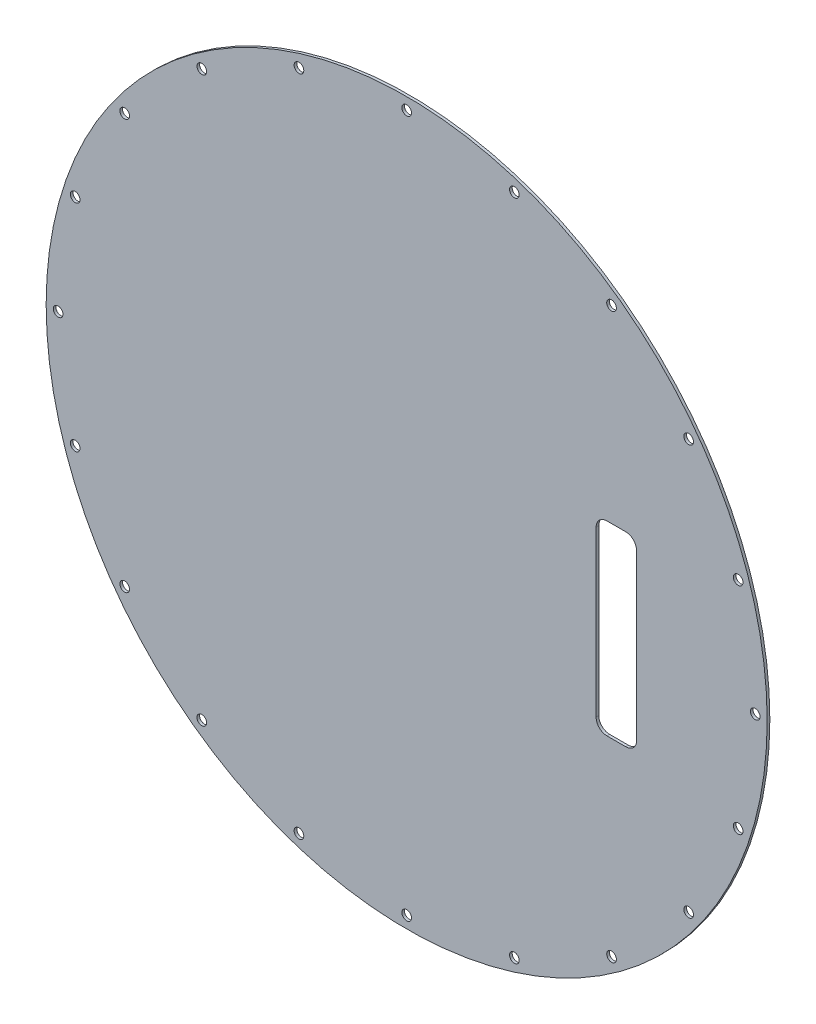
ISO-10303-21;
HEADER;
FILE_DESCRIPTION(('STEP AP214'),'2;1');
FILE_NAME('part.step','',(''),(''),'','','');
FILE_SCHEMA(('AUTOMOTIVE_DESIGN { 1 0 10303 214 1 1 1 1 }'));
ENDSEC;
DATA;
#1=APPLICATION_CONTEXT('core data for automotive mechanical design processes');
#2=APPLICATION_PROTOCOL_DEFINITION('international standard','automotive_design',2000,#1);
#3=PRODUCT_CONTEXT('',#1,'mechanical');
#4=PRODUCT('Part','Part','',(#3));
#5=PRODUCT_RELATED_PRODUCT_CATEGORY('part','',(#4));
#6=PRODUCT_DEFINITION_FORMATION('','',#4);
#7=PRODUCT_DEFINITION_CONTEXT('part definition',#1,'design');
#8=PRODUCT_DEFINITION('design','',#6,#7);
#9=PRODUCT_DEFINITION_SHAPE('','',#8);
#10=(LENGTH_UNIT() NAMED_UNIT(*) SI_UNIT(.MILLI.,.METRE.));
#11=(NAMED_UNIT(*) PLANE_ANGLE_UNIT() SI_UNIT($,.RADIAN.));
#12=(NAMED_UNIT(*) SI_UNIT($,.STERADIAN.) SOLID_ANGLE_UNIT());
#13=UNCERTAINTY_MEASURE_WITH_UNIT(LENGTH_MEASURE(1.E-05),#10,'distance_accuracy_value','');
#14=(GEOMETRIC_REPRESENTATION_CONTEXT(3) GLOBAL_UNCERTAINTY_ASSIGNED_CONTEXT((#13)) GLOBAL_UNIT_ASSIGNED_CONTEXT((#10,
#11,#12)) REPRESENTATION_CONTEXT('',''));
#15=CARTESIAN_POINT('',(0.,0.,0.));
#16=DIRECTION('',(0.,0.,1.));
#17=DIRECTION('',(1.,0.,0.));
#18=AXIS2_PLACEMENT_3D('',#15,#16,#17);
#19=CARTESIAN_POINT('',(-3.7031892570142E-13,0.,230.98252));
#20=DIRECTION('',(0.,0.,1.));
#21=DIRECTION('',(1.,0.,0.));
#22=AXIS2_PLACEMENT_3D('',#19,#20,#21);
#23=PLANE('',#22);
#24=CARTESIAN_POINT('',(86.0490700642058,62.518308896957,230.98252));
#25=DIRECTION('',(0.,0.,-1.));
#26=DIRECTION('',(-1.,0.,0.));
#27=AXIS2_PLACEMENT_3D('',#24,#25,#26);
#28=CIRCLE('',#27,1.47319999999999);
#29=CARTESIAN_POINT('',(84.5758700642058,62.518308896957,230.98252));
#30=VERTEX_POINT('',#29);
#31=EDGE_CURVE('E263',#30,#30,#28,.F.);
#32=ORIENTED_EDGE('',*,*,#31,.T.);
#33=EDGE_LOOP('',(#32));
#34=FACE_BOUND('',#33,.T.);
#35=CARTESIAN_POINT('',(-32.8678200642047,101.156748714444,230.98252));
#36=DIRECTION('',(0.,0.,-1.));
#37=DIRECTION('',(-1.,0.,0.));
#38=AXIS2_PLACEMENT_3D('',#35,#36,#37);
#39=CIRCLE('',#38,1.4732);
#40=CARTESIAN_POINT('',(-34.3410200642047,101.156748714444,230.98252));
#41=VERTEX_POINT('',#40);
#42=EDGE_CURVE('E257',#41,#41,#39,.F.);
#43=ORIENTED_EDGE('',*,*,#42,.T.);
#44=EDGE_LOOP('',(#43));
#45=FACE_BOUND('',#44,.T.);
#46=CARTESIAN_POINT('',(-62.5183088969577,86.0490700642059,230.98252));
#47=DIRECTION('',(0.,0.,-1.));
#48=DIRECTION('',(-1.,0.,0.));
#49=AXIS2_PLACEMENT_3D('',#46,#47,#48);
#50=CIRCLE('',#49,1.47320000000001);
#51=CARTESIAN_POINT('',(-63.9915088969577,86.0490700642059,230.98252));
#52=VERTEX_POINT('',#51);
#53=EDGE_CURVE('E212',#52,#52,#50,.F.);
#54=ORIENTED_EDGE('',*,*,#53,.T.);
#55=EDGE_LOOP('',(#54));
#56=FACE_BOUND('',#55,.T.);
#57=CARTESIAN_POINT('',(-86.0490700642052,62.5183088969589,230.98252));
#58=DIRECTION('',(0.,0.,-1.));
#59=DIRECTION('',(-1.,0.,0.));
#60=AXIS2_PLACEMENT_3D('',#57,#58,#59);
#61=CIRCLE('',#60,1.47319999999999);
#62=CARTESIAN_POINT('',(-87.5222700642052,62.5183088969589,230.98252));
#63=VERTEX_POINT('',#62);
#64=EDGE_CURVE('E215',#63,#63,#61,.F.);
#65=ORIENTED_EDGE('',*,*,#64,.T.);
#66=EDGE_LOOP('',(#65));
#67=FACE_BOUND('',#66,.T.);
#68=CARTESIAN_POINT('',(-106.3625,0.,230.98252));
#69=DIRECTION('',(0.,0.,-1.));
#70=DIRECTION('',(-1.,0.,0.));
#71=AXIS2_PLACEMENT_3D('',#68,#69,#70);
#72=CIRCLE('',#71,1.47319999999999);
#73=CARTESIAN_POINT('',(-107.8357,0.,230.98252));
#74=VERTEX_POINT('',#73);
#75=EDGE_CURVE('E251',#74,#74,#72,.F.);
#76=ORIENTED_EDGE('',*,*,#75,.T.);
#77=EDGE_LOOP('',(#76));
#78=FACE_BOUND('',#77,.T.);
#79=CARTESIAN_POINT('',(-101.156748714444,-32.8678200642047,230.98252));
#80=DIRECTION('',(0.,0.,-1.));
#81=DIRECTION('',(-1.,0.,0.));
#82=AXIS2_PLACEMENT_3D('',#79,#80,#81);
#83=CIRCLE('',#82,1.47319999999999);
#84=CARTESIAN_POINT('',(-102.629948714444,-32.8678200642047,230.98252));
#85=VERTEX_POINT('',#84);
#86=EDGE_CURVE('E218',#85,#85,#83,.F.);
#87=ORIENTED_EDGE('',*,*,#86,.T.);
#88=EDGE_LOOP('',(#87));
#89=FACE_BOUND('',#88,.T.);
#90=CARTESIAN_POINT('',(-86.0490700642061,-62.5183088969577,230.98252));
#91=DIRECTION('',(0.,0.,-1.));
#92=DIRECTION('',(-1.,0.,0.));
#93=AXIS2_PLACEMENT_3D('',#90,#91,#92);
#94=CIRCLE('',#93,1.47319999999999);
#95=CARTESIAN_POINT('',(-87.5222700642061,-62.5183088969577,230.98252));
#96=VERTEX_POINT('',#95);
#97=EDGE_CURVE('E221',#96,#96,#94,.F.);
#98=ORIENTED_EDGE('',*,*,#97,.T.);
#99=EDGE_LOOP('',(#98));
#100=FACE_BOUND('',#99,.T.);
#101=CARTESIAN_POINT('',(-62.518308896959,-86.049070064205,230.98252));
#102=DIRECTION('',(0.,0.,-1.));
#103=DIRECTION('',(-1.,0.,0.));
#104=AXIS2_PLACEMENT_3D('',#101,#102,#103);
#105=CIRCLE('',#104,1.47319999999999);
#106=CARTESIAN_POINT('',(-63.991508896959,-86.049070064205,230.98252));
#107=VERTEX_POINT('',#106);
#108=EDGE_CURVE('E224',#107,#107,#105,.F.);
#109=ORIENTED_EDGE('',*,*,#108,.T.);
#110=EDGE_LOOP('',(#109));
#111=FACE_BOUND('',#110,.T.);
#112=CARTESIAN_POINT('',(-3.7031892570142E-13,0.,230.98252));
#113=DIRECTION('',(0.,0.,-1.));
#114=DIRECTION('',(-1.,0.,0.));
#115=AXIS2_PLACEMENT_3D('',#112,#113,#114);
#116=CIRCLE('',#115,110.01375);
#117=CARTESIAN_POINT('',(-110.01375,0.,230.98252));
#118=VERTEX_POINT('',#117);
#119=EDGE_CURVE('E248',#118,#118,#116,.F.);
#120=ORIENTED_EDGE('',*,*,#119,.F.);
#121=EDGE_LOOP('',(#120));
#122=FACE_BOUND('',#121,.T.);
#123=CARTESIAN_POINT('',(106.3625,0.,230.98252));
#124=DIRECTION('',(0.,0.,-1.));
#125=DIRECTION('',(-1.,0.,0.));
#126=AXIS2_PLACEMENT_3D('',#123,#124,#125);
#127=CIRCLE('',#126,1.47319999999999);
#128=CARTESIAN_POINT('',(104.8893,0.,230.98252));
#129=VERTEX_POINT('',#128);
#130=EDGE_CURVE('E245',#129,#129,#127,.F.);
#131=ORIENTED_EDGE('',*,*,#130,.T.);
#132=EDGE_LOOP('',(#131));
#133=FACE_BOUND('',#132,.T.);
#134=CARTESIAN_POINT('',(101.156748714443,-32.8678200642054,230.98252));
#135=DIRECTION('',(0.,0.,-1.));
#136=DIRECTION('',(-1.,0.,0.));
#137=AXIS2_PLACEMENT_3D('',#134,#135,#136);
#138=CIRCLE('',#137,1.47319999999999);
#139=CARTESIAN_POINT('',(99.6835487144429,-32.8678200642054,230.98252));
#140=VERTEX_POINT('',#139);
#141=EDGE_CURVE('E242',#140,#140,#138,.F.);
#142=ORIENTED_EDGE('',*,*,#141,.T.);
#143=EDGE_LOOP('',(#142));
#144=FACE_BOUND('',#143,.T.);
#145=CARTESIAN_POINT('',(86.0490700642049,-62.5183088969583,230.98252));
#146=DIRECTION('',(0.,0.,-1.));
#147=DIRECTION('',(-1.,0.,0.));
#148=AXIS2_PLACEMENT_3D('',#145,#146,#147);
#149=CIRCLE('',#148,1.47319999999999);
#150=CARTESIAN_POINT('',(84.5758700642049,-62.5183088969583,230.98252));
#151=VERTEX_POINT('',#150);
#152=EDGE_CURVE('E239',#151,#151,#149,.F.);
#153=ORIENTED_EDGE('',*,*,#152,.T.);
#154=EDGE_LOOP('',(#153));
#155=FACE_BOUND('',#154,.T.);
#156=CARTESIAN_POINT('',(62.5183088969576,-86.0490700642055,230.98252));
#157=DIRECTION('',(0.,0.,-1.));
#158=DIRECTION('',(-1.,0.,0.));
#159=AXIS2_PLACEMENT_3D('',#156,#157,#158);
#160=CIRCLE('',#159,1.47319999999999);
#161=CARTESIAN_POINT('',(61.0451088969576,-86.0490700642055,230.98252));
#162=VERTEX_POINT('',#161);
#163=EDGE_CURVE('E236',#162,#162,#160,.F.);
#164=ORIENTED_EDGE('',*,*,#163,.T.);
#165=EDGE_LOOP('',(#164));
#166=FACE_BOUND('',#165,.T.);
#167=CARTESIAN_POINT('',(32.8678200642047,-101.156748714443,230.98252));
#168=DIRECTION('',(0.,0.,-1.));
#169=DIRECTION('',(-1.,0.,0.));
#170=AXIS2_PLACEMENT_3D('',#167,#168,#169);
#171=CIRCLE('',#170,1.4732);
#172=CARTESIAN_POINT('',(31.3946200642047,-101.156748714443,230.98252));
#173=VERTEX_POINT('',#172);
#174=EDGE_CURVE('E233',#173,#173,#171,.F.);
#175=ORIENTED_EDGE('',*,*,#174,.T.);
#176=EDGE_LOOP('',(#175));
#177=FACE_BOUND('',#176,.T.);
#178=CARTESIAN_POINT('',(-7.41681609604123E-13,-106.3625,230.98252));
#179=DIRECTION('',(0.,0.,-1.));
#180=DIRECTION('',(-1.,0.,0.));
#181=AXIS2_PLACEMENT_3D('',#178,#179,#180);
#182=CIRCLE('',#181,1.4732);
#183=CARTESIAN_POINT('',(-1.47320000000074,-106.3625,230.98252));
#184=VERTEX_POINT('',#183);
#185=EDGE_CURVE('E230',#184,#184,#182,.F.);
#186=ORIENTED_EDGE('',*,*,#185,.T.);
#187=EDGE_LOOP('',(#186));
#188=FACE_BOUND('',#187,.T.);
#189=CARTESIAN_POINT('',(-32.8678200642062,-101.156748714443,230.98252));
#190=DIRECTION('',(0.,0.,-1.));
#191=DIRECTION('',(-1.,0.,0.));
#192=AXIS2_PLACEMENT_3D('',#189,#190,#191);
#193=CIRCLE('',#192,1.4732);
#194=CARTESIAN_POINT('',(-34.3410200642062,-101.156748714443,230.98252));
#195=VERTEX_POINT('',#194);
#196=EDGE_CURVE('E227',#195,#195,#193,.F.);
#197=ORIENTED_EDGE('',*,*,#196,.T.);
#198=EDGE_LOOP('',(#197));
#199=FACE_BOUND('',#198,.T.);
#200=CARTESIAN_POINT('',(-101.156748714443,32.8678200642061,230.98252));
#201=DIRECTION('',(0.,0.,-1.));
#202=DIRECTION('',(-1.,0.,0.));
#203=AXIS2_PLACEMENT_3D('',#200,#201,#202);
#204=CIRCLE('',#203,1.47319999999999);
#205=CARTESIAN_POINT('',(-102.629948714443,32.8678200642061,230.98252));
#206=VERTEX_POINT('',#205);
#207=EDGE_CURVE('E254',#206,#206,#204,.F.);
#208=ORIENTED_EDGE('',*,*,#207,.T.);
#209=EDGE_LOOP('',(#208));
#210=FACE_BOUND('',#209,.T.);
#211=CARTESIAN_POINT('',(7.43769126006688E-13,106.3625,230.98252));
#212=DIRECTION('',(0.,0.,-1.));
#213=DIRECTION('',(-1.,0.,0.));
#214=AXIS2_PLACEMENT_3D('',#211,#212,#213);
#215=CIRCLE('',#214,1.4732);
#216=CARTESIAN_POINT('',(-1.47319999999926,106.3625,230.98252));
#217=VERTEX_POINT('',#216);
#218=EDGE_CURVE('E260',#217,#217,#215,.F.);
#219=ORIENTED_EDGE('',*,*,#218,.T.);
#220=EDGE_LOOP('',(#219));
#221=FACE_BOUND('',#220,.T.);
#222=CARTESIAN_POINT('',(32.8678200642061,101.156748714443,230.98252));
#223=DIRECTION('',(0.,0.,-1.));
#224=DIRECTION('',(-1.,0.,0.));
#225=AXIS2_PLACEMENT_3D('',#222,#223,#224);
#226=CIRCLE('',#225,1.4732);
#227=CARTESIAN_POINT('',(31.3946200642061,101.156748714443,230.98252));
#228=VERTEX_POINT('',#227);
#229=EDGE_CURVE('E209',#228,#228,#226,.F.);
#230=ORIENTED_EDGE('',*,*,#229,.T.);
#231=EDGE_LOOP('',(#230));
#232=FACE_BOUND('',#231,.T.);
#233=CARTESIAN_POINT('',(62.5183088969588,86.0490700642046,230.98252));
#234=DIRECTION('',(0.,0.,-1.));
#235=DIRECTION('',(-1.,0.,0.));
#236=AXIS2_PLACEMENT_3D('',#233,#234,#235);
#237=CIRCLE('',#236,1.47319999999999);
#238=CARTESIAN_POINT('',(61.0451088969589,86.0490700642046,230.98252));
#239=VERTEX_POINT('',#238);
#240=EDGE_CURVE('E206',#239,#239,#237,.F.);
#241=ORIENTED_EDGE('',*,*,#240,.T.);
#242=EDGE_LOOP('',(#241));
#243=FACE_BOUND('',#242,.T.);
#244=CARTESIAN_POINT('',(101.156748714443,32.867820064204,230.98252));
#245=DIRECTION('',(0.,0.,-1.));
#246=DIRECTION('',(-1.,0.,0.));
#247=AXIS2_PLACEMENT_3D('',#244,#245,#246);
#248=CIRCLE('',#247,1.47319999999999);
#249=CARTESIAN_POINT('',(99.6835487144433,32.867820064204,230.98252));
#250=VERTEX_POINT('',#249);
#251=EDGE_CURVE('E203',#250,#250,#248,.F.);
#252=ORIENTED_EDGE('',*,*,#251,.T.);
#253=EDGE_LOOP('',(#252));
#254=FACE_BOUND('',#253,.T.);
#255=DIRECTION('',(1.,0.,0.));
#256=VECTOR('',#255,1.);
#257=CARTESIAN_POINT('',(0.,28.4,230.98252));
#258=LINE('',#257,#256);
#259=CARTESIAN_POINT('',(61.1096,28.4,230.98252));
#260=VERTEX_POINT('',#259);
#261=CARTESIAN_POINT('',(66.8556,28.4,230.98252));
#262=VERTEX_POINT('',#261);
#263=EDGE_CURVE('E134',#260,#262,#258,.T.);
#264=ORIENTED_EDGE('',*,*,#263,.F.);
#265=CARTESIAN_POINT('',(61.1096,25.098,230.98252));
#266=DIRECTION('',(0.,0.,1.));
#267=DIRECTION('',(1.,0.,0.));
#268=AXIS2_PLACEMENT_3D('',#265,#266,#267);
#269=CIRCLE('',#268,3.302);
#270=CARTESIAN_POINT('',(57.8076,25.098,230.98252));
#271=VERTEX_POINT('',#270);
#272=EDGE_CURVE('E11',#260,#271,#269,.T.);
#273=ORIENTED_EDGE('',*,*,#272,.T.);
#274=DIRECTION('',(0.,-1.,0.));
#275=VECTOR('',#274,1.);
#276=CARTESIAN_POINT('',(57.8076,0.,230.98252));
#277=LINE('',#276,#275);
#278=CARTESIAN_POINT('',(57.8076,-25.098,230.98252));
#279=VERTEX_POINT('',#278);
#280=EDGE_CURVE('E293',#271,#279,#277,.T.);
#281=ORIENTED_EDGE('',*,*,#280,.T.);
#282=CARTESIAN_POINT('',(61.1096,-25.098,230.98252));
#283=DIRECTION('',(0.,0.,1.));
#284=DIRECTION('',(1.,0.,0.));
#285=AXIS2_PLACEMENT_3D('',#282,#283,#284);
#286=CIRCLE('',#285,3.302);
#287=CARTESIAN_POINT('',(61.1096,-28.4,230.98252));
#288=VERTEX_POINT('',#287);
#289=EDGE_CURVE('E114',#279,#288,#286,.T.);
#290=ORIENTED_EDGE('',*,*,#289,.T.);
#291=DIRECTION('',(1.,0.,0.));
#292=VECTOR('',#291,1.);
#293=CARTESIAN_POINT('',(0.,-28.4,230.98252));
#294=LINE('',#293,#292);
#295=CARTESIAN_POINT('',(66.8556,-28.4,230.98252));
#296=VERTEX_POINT('',#295);
#297=EDGE_CURVE('E124',#288,#296,#294,.T.);
#298=ORIENTED_EDGE('',*,*,#297,.T.);
#299=CARTESIAN_POINT('',(66.8556,-25.098,230.98252));
#300=DIRECTION('',(0.,0.,1.));
#301=DIRECTION('',(1.,0.,0.));
#302=AXIS2_PLACEMENT_3D('',#299,#300,#301);
#303=CIRCLE('',#302,3.302);
#304=CARTESIAN_POINT('',(70.1576,-25.098,230.98252));
#305=VERTEX_POINT('',#304);
#306=EDGE_CURVE('E281',#296,#305,#303,.T.);
#307=ORIENTED_EDGE('',*,*,#306,.T.);
#308=DIRECTION('',(0.,-1.,0.));
#309=VECTOR('',#308,1.);
#310=CARTESIAN_POINT('',(70.1576,0.,230.98252));
#311=LINE('',#310,#309);
#312=CARTESIAN_POINT('',(70.1576,25.098,230.98252));
#313=VERTEX_POINT('',#312);
#314=EDGE_CURVE('E266',#313,#305,#311,.T.);
#315=ORIENTED_EDGE('',*,*,#314,.F.);
#316=CARTESIAN_POINT('',(66.8556,25.098,230.98252));
#317=DIRECTION('',(0.,0.,1.));
#318=DIRECTION('',(1.,0.,0.));
#319=AXIS2_PLACEMENT_3D('',#316,#317,#318);
#320=CIRCLE('',#319,3.302);
#321=EDGE_CURVE('E53',#313,#262,#320,.T.);
#322=ORIENTED_EDGE('',*,*,#321,.T.);
#323=EDGE_LOOP('',(#264,#273,#281,#290,#298,#307,#315,#322));
#324=FACE_BOUND('',#323,.T.);
#325=ADVANCED_FACE('F38',(#34,#45,#56,#67,#78,#89,#100,#111,#122,#133,#144,#155,#166,#177,#188,
#199,#210,#221,#232,#243,#254,#324),#23,.F.);
#326=CARTESIAN_POINT('',(-3.7031892570142E-13,0.,231.79532));
#327=DIRECTION('',(0.,0.,1.));
#328=DIRECTION('',(1.,0.,0.));
#329=AXIS2_PLACEMENT_3D('',#326,#327,#328);
#330=PLANE('',#329);
#331=CARTESIAN_POINT('',(101.156748714443,32.867820064204,231.79532));
#332=DIRECTION('',(0.,0.,-1.));
#333=DIRECTION('',(-1.,0.,0.));
#334=AXIS2_PLACEMENT_3D('',#331,#332,#333);
#335=CIRCLE('',#334,1.47319999999999);
#336=CARTESIAN_POINT('',(99.6835487144433,32.867820064204,231.79532));
#337=VERTEX_POINT('',#336);
#338=EDGE_CURVE('E140',#337,#337,#335,.T.);
#339=ORIENTED_EDGE('',*,*,#338,.T.);
#340=EDGE_LOOP('',(#339));
#341=FACE_BOUND('',#340,.T.);
#342=CARTESIAN_POINT('',(62.5183088969588,86.0490700642046,231.79532));
#343=DIRECTION('',(0.,0.,-1.));
#344=DIRECTION('',(-1.,0.,0.));
#345=AXIS2_PLACEMENT_3D('',#342,#343,#344);
#346=CIRCLE('',#345,1.47319999999999);
#347=CARTESIAN_POINT('',(61.0451088969589,86.0490700642046,231.79532));
#348=VERTEX_POINT('',#347);
#349=EDGE_CURVE('E143',#348,#348,#346,.T.);
#350=ORIENTED_EDGE('',*,*,#349,.T.);
#351=EDGE_LOOP('',(#350));
#352=FACE_BOUND('',#351,.T.);
#353=CARTESIAN_POINT('',(32.8678200642061,101.156748714443,231.79532));
#354=DIRECTION('',(0.,0.,-1.));
#355=DIRECTION('',(-1.,0.,0.));
#356=AXIS2_PLACEMENT_3D('',#353,#354,#355);
#357=CIRCLE('',#356,1.4732);
#358=CARTESIAN_POINT('',(31.3946200642061,101.156748714443,231.79532));
#359=VERTEX_POINT('',#358);
#360=EDGE_CURVE('E146',#359,#359,#357,.T.);
#361=ORIENTED_EDGE('',*,*,#360,.T.);
#362=EDGE_LOOP('',(#361));
#363=FACE_BOUND('',#362,.T.);
#364=CARTESIAN_POINT('',(-62.5183088969577,86.0490700642059,231.79532));
#365=DIRECTION('',(0.,0.,-1.));
#366=DIRECTION('',(-1.,0.,0.));
#367=AXIS2_PLACEMENT_3D('',#364,#365,#366);
#368=CIRCLE('',#367,1.47320000000001);
#369=CARTESIAN_POINT('',(-63.9915088969577,86.0490700642059,231.79532));
#370=VERTEX_POINT('',#369);
#371=EDGE_CURVE('E149',#370,#370,#368,.T.);
#372=ORIENTED_EDGE('',*,*,#371,.T.);
#373=EDGE_LOOP('',(#372));
#374=FACE_BOUND('',#373,.T.);
#375=CARTESIAN_POINT('',(-86.0490700642052,62.5183088969589,231.79532));
#376=DIRECTION('',(0.,0.,-1.));
#377=DIRECTION('',(-1.,0.,0.));
#378=AXIS2_PLACEMENT_3D('',#375,#376,#377);
#379=CIRCLE('',#378,1.47319999999999);
#380=CARTESIAN_POINT('',(-87.5222700642052,62.5183088969589,231.79532));
#381=VERTEX_POINT('',#380);
#382=EDGE_CURVE('E152',#381,#381,#379,.T.);
#383=ORIENTED_EDGE('',*,*,#382,.T.);
#384=EDGE_LOOP('',(#383));
#385=FACE_BOUND('',#384,.T.);
#386=CARTESIAN_POINT('',(-101.156748714444,-32.8678200642047,231.79532));
#387=DIRECTION('',(0.,0.,-1.));
#388=DIRECTION('',(-1.,0.,0.));
#389=AXIS2_PLACEMENT_3D('',#386,#387,#388);
#390=CIRCLE('',#389,1.47319999999999);
#391=CARTESIAN_POINT('',(-102.629948714444,-32.8678200642047,231.79532));
#392=VERTEX_POINT('',#391);
#393=EDGE_CURVE('E155',#392,#392,#390,.T.);
#394=ORIENTED_EDGE('',*,*,#393,.T.);
#395=EDGE_LOOP('',(#394));
#396=FACE_BOUND('',#395,.T.);
#397=CARTESIAN_POINT('',(-86.0490700642061,-62.5183088969577,231.79532));
#398=DIRECTION('',(0.,0.,-1.));
#399=DIRECTION('',(-1.,0.,0.));
#400=AXIS2_PLACEMENT_3D('',#397,#398,#399);
#401=CIRCLE('',#400,1.47319999999999);
#402=CARTESIAN_POINT('',(-87.5222700642061,-62.5183088969577,231.79532));
#403=VERTEX_POINT('',#402);
#404=EDGE_CURVE('E158',#403,#403,#401,.T.);
#405=ORIENTED_EDGE('',*,*,#404,.T.);
#406=EDGE_LOOP('',(#405));
#407=FACE_BOUND('',#406,.T.);
#408=CARTESIAN_POINT('',(-62.518308896959,-86.049070064205,231.79532));
#409=DIRECTION('',(0.,0.,-1.));
#410=DIRECTION('',(-1.,0.,0.));
#411=AXIS2_PLACEMENT_3D('',#408,#409,#410);
#412=CIRCLE('',#411,1.47319999999999);
#413=CARTESIAN_POINT('',(-63.991508896959,-86.049070064205,231.79532));
#414=VERTEX_POINT('',#413);
#415=EDGE_CURVE('E161',#414,#414,#412,.T.);
#416=ORIENTED_EDGE('',*,*,#415,.T.);
#417=EDGE_LOOP('',(#416));
#418=FACE_BOUND('',#417,.T.);
#419=CARTESIAN_POINT('',(-32.8678200642062,-101.156748714443,231.79532));
#420=DIRECTION('',(0.,0.,-1.));
#421=DIRECTION('',(-1.,0.,0.));
#422=AXIS2_PLACEMENT_3D('',#419,#420,#421);
#423=CIRCLE('',#422,1.4732);
#424=CARTESIAN_POINT('',(-34.3410200642062,-101.156748714443,231.79532));
#425=VERTEX_POINT('',#424);
#426=EDGE_CURVE('E164',#425,#425,#423,.T.);
#427=ORIENTED_EDGE('',*,*,#426,.T.);
#428=EDGE_LOOP('',(#427));
#429=FACE_BOUND('',#428,.T.);
#430=CARTESIAN_POINT('',(-7.41681609604123E-13,-106.3625,231.79532));
#431=DIRECTION('',(0.,0.,-1.));
#432=DIRECTION('',(-1.,0.,0.));
#433=AXIS2_PLACEMENT_3D('',#430,#431,#432);
#434=CIRCLE('',#433,1.4732);
#435=CARTESIAN_POINT('',(-1.47320000000074,-106.3625,231.79532));
#436=VERTEX_POINT('',#435);
#437=EDGE_CURVE('E167',#436,#436,#434,.T.);
#438=ORIENTED_EDGE('',*,*,#437,.T.);
#439=EDGE_LOOP('',(#438));
#440=FACE_BOUND('',#439,.T.);
#441=CARTESIAN_POINT('',(32.8678200642047,-101.156748714443,231.79532));
#442=DIRECTION('',(0.,0.,-1.));
#443=DIRECTION('',(-1.,0.,0.));
#444=AXIS2_PLACEMENT_3D('',#441,#442,#443);
#445=CIRCLE('',#444,1.4732);
#446=CARTESIAN_POINT('',(31.3946200642047,-101.156748714443,231.79532));
#447=VERTEX_POINT('',#446);
#448=EDGE_CURVE('E170',#447,#447,#445,.T.);
#449=ORIENTED_EDGE('',*,*,#448,.T.);
#450=EDGE_LOOP('',(#449));
#451=FACE_BOUND('',#450,.T.);
#452=CARTESIAN_POINT('',(62.5183088969576,-86.0490700642055,231.79532));
#453=DIRECTION('',(0.,0.,-1.));
#454=DIRECTION('',(-1.,0.,0.));
#455=AXIS2_PLACEMENT_3D('',#452,#453,#454);
#456=CIRCLE('',#455,1.47319999999999);
#457=CARTESIAN_POINT('',(61.0451088969576,-86.0490700642055,231.79532));
#458=VERTEX_POINT('',#457);
#459=EDGE_CURVE('E173',#458,#458,#456,.T.);
#460=ORIENTED_EDGE('',*,*,#459,.T.);
#461=EDGE_LOOP('',(#460));
#462=FACE_BOUND('',#461,.T.);
#463=CARTESIAN_POINT('',(86.0490700642049,-62.5183088969583,231.79532));
#464=DIRECTION('',(0.,0.,-1.));
#465=DIRECTION('',(-1.,0.,0.));
#466=AXIS2_PLACEMENT_3D('',#463,#464,#465);
#467=CIRCLE('',#466,1.47319999999999);
#468=CARTESIAN_POINT('',(84.5758700642049,-62.5183088969583,231.79532));
#469=VERTEX_POINT('',#468);
#470=EDGE_CURVE('E176',#469,#469,#467,.T.);
#471=ORIENTED_EDGE('',*,*,#470,.T.);
#472=EDGE_LOOP('',(#471));
#473=FACE_BOUND('',#472,.T.);
#474=CARTESIAN_POINT('',(101.156748714443,-32.8678200642054,231.79532));
#475=DIRECTION('',(0.,0.,-1.));
#476=DIRECTION('',(-1.,0.,0.));
#477=AXIS2_PLACEMENT_3D('',#474,#475,#476);
#478=CIRCLE('',#477,1.47319999999999);
#479=CARTESIAN_POINT('',(99.6835487144429,-32.8678200642054,231.79532));
#480=VERTEX_POINT('',#479);
#481=EDGE_CURVE('E179',#480,#480,#478,.T.);
#482=ORIENTED_EDGE('',*,*,#481,.T.);
#483=EDGE_LOOP('',(#482));
#484=FACE_BOUND('',#483,.T.);
#485=CARTESIAN_POINT('',(106.3625,0.,231.79532));
#486=DIRECTION('',(0.,0.,-1.));
#487=DIRECTION('',(-1.,0.,0.));
#488=AXIS2_PLACEMENT_3D('',#485,#486,#487);
#489=CIRCLE('',#488,1.47319999999999);
#490=CARTESIAN_POINT('',(104.8893,0.,231.79532));
#491=VERTEX_POINT('',#490);
#492=EDGE_CURVE('E182',#491,#491,#489,.T.);
#493=ORIENTED_EDGE('',*,*,#492,.T.);
#494=EDGE_LOOP('',(#493));
#495=FACE_BOUND('',#494,.T.);
#496=CARTESIAN_POINT('',(-3.7031892570142E-13,0.,231.79532));
#497=DIRECTION('',(0.,0.,-1.));
#498=DIRECTION('',(-1.,0.,0.));
#499=AXIS2_PLACEMENT_3D('',#496,#497,#498);
#500=CIRCLE('',#499,110.01375);
#501=CARTESIAN_POINT('',(-110.01375,0.,231.79532));
#502=VERTEX_POINT('',#501);
#503=EDGE_CURVE('E185',#502,#502,#500,.F.);
#504=ORIENTED_EDGE('',*,*,#503,.T.);
#505=EDGE_LOOP('',(#504));
#506=FACE_BOUND('',#505,.T.);
#507=CARTESIAN_POINT('',(-106.3625,0.,231.79532));
#508=DIRECTION('',(0.,0.,-1.));
#509=DIRECTION('',(-1.,0.,0.));
#510=AXIS2_PLACEMENT_3D('',#507,#508,#509);
#511=CIRCLE('',#510,1.47319999999999);
#512=CARTESIAN_POINT('',(-107.8357,0.,231.79532));
#513=VERTEX_POINT('',#512);
#514=EDGE_CURVE('E188',#513,#513,#511,.T.);
#515=ORIENTED_EDGE('',*,*,#514,.T.);
#516=EDGE_LOOP('',(#515));
#517=FACE_BOUND('',#516,.T.);
#518=CARTESIAN_POINT('',(-101.156748714443,32.8678200642061,231.79532));
#519=DIRECTION('',(0.,0.,-1.));
#520=DIRECTION('',(-1.,0.,0.));
#521=AXIS2_PLACEMENT_3D('',#518,#519,#520);
#522=CIRCLE('',#521,1.47319999999999);
#523=CARTESIAN_POINT('',(-102.629948714443,32.8678200642061,231.79532));
#524=VERTEX_POINT('',#523);
#525=EDGE_CURVE('E191',#524,#524,#522,.T.);
#526=ORIENTED_EDGE('',*,*,#525,.T.);
#527=EDGE_LOOP('',(#526));
#528=FACE_BOUND('',#527,.T.);
#529=CARTESIAN_POINT('',(-32.8678200642047,101.156748714444,231.79532));
#530=DIRECTION('',(0.,0.,-1.));
#531=DIRECTION('',(-1.,0.,0.));
#532=AXIS2_PLACEMENT_3D('',#529,#530,#531);
#533=CIRCLE('',#532,1.4732);
#534=CARTESIAN_POINT('',(-34.3410200642047,101.156748714444,231.79532));
#535=VERTEX_POINT('',#534);
#536=EDGE_CURVE('E194',#535,#535,#533,.T.);
#537=ORIENTED_EDGE('',*,*,#536,.T.);
#538=EDGE_LOOP('',(#537));
#539=FACE_BOUND('',#538,.T.);
#540=CARTESIAN_POINT('',(7.43769126006688E-13,106.3625,231.79532));
#541=DIRECTION('',(0.,0.,-1.));
#542=DIRECTION('',(-1.,0.,0.));
#543=AXIS2_PLACEMENT_3D('',#540,#541,#542);
#544=CIRCLE('',#543,1.4732);
#545=CARTESIAN_POINT('',(-1.47319999999926,106.3625,231.79532));
#546=VERTEX_POINT('',#545);
#547=EDGE_CURVE('E197',#546,#546,#544,.T.);
#548=ORIENTED_EDGE('',*,*,#547,.T.);
#549=EDGE_LOOP('',(#548));
#550=FACE_BOUND('',#549,.T.);
#551=CARTESIAN_POINT('',(86.0490700642058,62.518308896957,231.79532));
#552=DIRECTION('',(0.,0.,-1.));
#553=DIRECTION('',(-1.,0.,0.));
#554=AXIS2_PLACEMENT_3D('',#551,#552,#553);
#555=CIRCLE('',#554,1.47319999999999);
#556=CARTESIAN_POINT('',(84.5758700642058,62.518308896957,231.79532));
#557=VERTEX_POINT('',#556);
#558=EDGE_CURVE('E200',#557,#557,#555,.T.);
#559=ORIENTED_EDGE('',*,*,#558,.T.);
#560=EDGE_LOOP('',(#559));
#561=FACE_BOUND('',#560,.T.);
#562=DIRECTION('',(0.,-1.,0.));
#563=VECTOR('',#562,1.);
#564=CARTESIAN_POINT('',(57.8076,0.,231.79532));
#565=LINE('',#564,#563);
#566=CARTESIAN_POINT('',(57.8076,25.098,231.79532));
#567=VERTEX_POINT('',#566);
#568=CARTESIAN_POINT('',(57.8076,-25.098,231.79532));
#569=VERTEX_POINT('',#568);
#570=EDGE_CURVE('E132',#567,#569,#565,.T.);
#571=ORIENTED_EDGE('',*,*,#570,.F.);
#572=CARTESIAN_POINT('',(61.1096,25.098,231.79532));
#573=DIRECTION('',(0.,0.,1.));
#574=DIRECTION('',(1.,0.,0.));
#575=AXIS2_PLACEMENT_3D('',#572,#573,#574);
#576=CIRCLE('',#575,3.302);
#577=CARTESIAN_POINT('',(61.1096,28.4,231.79532));
#578=VERTEX_POINT('',#577);
#579=EDGE_CURVE('E46',#567,#578,#576,.F.);
#580=ORIENTED_EDGE('',*,*,#579,.T.);
#581=DIRECTION('',(1.,0.,0.));
#582=VECTOR('',#581,1.);
#583=CARTESIAN_POINT('',(0.,28.4,231.79532));
#584=LINE('',#583,#582);
#585=CARTESIAN_POINT('',(66.8556,28.4,231.79532));
#586=VERTEX_POINT('',#585);
#587=EDGE_CURVE('E136',#578,#586,#584,.T.);
#588=ORIENTED_EDGE('',*,*,#587,.T.);
#589=CARTESIAN_POINT('',(66.8556,25.098,231.79532));
#590=DIRECTION('',(0.,0.,1.));
#591=DIRECTION('',(1.,0.,0.));
#592=AXIS2_PLACEMENT_3D('',#589,#590,#591);
#593=CIRCLE('',#592,3.302);
#594=CARTESIAN_POINT('',(70.1576,25.098,231.79532));
#595=VERTEX_POINT('',#594);
#596=EDGE_CURVE('E283',#586,#595,#593,.F.);
#597=ORIENTED_EDGE('',*,*,#596,.T.);
#598=DIRECTION('',(0.,-1.,0.));
#599=VECTOR('',#598,1.);
#600=CARTESIAN_POINT('',(70.1576,0.,231.79532));
#601=LINE('',#600,#599);
#602=CARTESIAN_POINT('',(70.1576,-25.098,231.79532));
#603=VERTEX_POINT('',#602);
#604=EDGE_CURVE('E131',#595,#603,#601,.T.);
#605=ORIENTED_EDGE('',*,*,#604,.T.);
#606=CARTESIAN_POINT('',(66.8556,-25.098,231.79532));
#607=DIRECTION('',(0.,0.,1.));
#608=DIRECTION('',(1.,0.,0.));
#609=AXIS2_PLACEMENT_3D('',#606,#607,#608);
#610=CIRCLE('',#609,3.302);
#611=CARTESIAN_POINT('',(66.8556,-28.4,231.79532));
#612=VERTEX_POINT('',#611);
#613=EDGE_CURVE('E130',#603,#612,#610,.F.);
#614=ORIENTED_EDGE('',*,*,#613,.T.);
#615=DIRECTION('',(1.,0.,0.));
#616=VECTOR('',#615,1.);
#617=CARTESIAN_POINT('',(0.,-28.4,231.79532));
#618=LINE('',#617,#616);
#619=CARTESIAN_POINT('',(61.1096,-28.4,231.79532));
#620=VERTEX_POINT('',#619);
#621=EDGE_CURVE('E121',#620,#612,#618,.T.);
#622=ORIENTED_EDGE('',*,*,#621,.F.);
#623=CARTESIAN_POINT('',(61.1096,-25.098,231.79532));
#624=DIRECTION('',(0.,0.,1.));
#625=DIRECTION('',(1.,0.,0.));
#626=AXIS2_PLACEMENT_3D('',#623,#624,#625);
#627=CIRCLE('',#626,3.302);
#628=EDGE_CURVE('E104',#620,#569,#627,.F.);
#629=ORIENTED_EDGE('',*,*,#628,.T.);
#630=EDGE_LOOP('',(#571,#580,#588,#597,#605,#614,#622,#629));
#631=FACE_BOUND('',#630,.T.);
#632=ADVANCED_FACE('F128',(#341,#352,#363,#374,#385,#396,#407,#418,#429,#440,#451,#462,#473,
#484,#495,#506,#517,#528,#539,#550,#561,#631),#330,.T.);
#633=CARTESIAN_POINT('',(86.0490700642058,62.518308896957,230.98252));
#634=DIRECTION('',(0.,0.,-1.));
#635=DIRECTION('',(-1.,0.,0.));
#636=AXIS2_PLACEMENT_3D('',#633,#634,#635);
#637=CYLINDRICAL_SURFACE('',#636,1.47319999999999);
#638=ORIENTED_EDGE('',*,*,#31,.F.);
#639=EDGE_LOOP('',(#638));
#640=FACE_BOUND('',#639,.T.);
#641=ORIENTED_EDGE('',*,*,#558,.F.);
#642=EDGE_LOOP('',(#641));
#643=FACE_BOUND('',#642,.T.);
#644=ADVANCED_FACE('F325',(#640,#643),#637,.F.);
#645=CARTESIAN_POINT('',(7.43769126006688E-13,106.3625,230.98252));
#646=DIRECTION('',(0.,0.,-1.));
#647=DIRECTION('',(-1.,0.,0.));
#648=AXIS2_PLACEMENT_3D('',#645,#646,#647);
#649=CYLINDRICAL_SURFACE('',#648,1.4732);
#650=ORIENTED_EDGE('',*,*,#218,.F.);
#651=EDGE_LOOP('',(#650));
#652=FACE_BOUND('',#651,.T.);
#653=ORIENTED_EDGE('',*,*,#547,.F.);
#654=EDGE_LOOP('',(#653));
#655=FACE_BOUND('',#654,.T.);
#656=ADVANCED_FACE('F333',(#652,#655),#649,.F.);
#657=CARTESIAN_POINT('',(-32.8678200642047,101.156748714444,230.98252));
#658=DIRECTION('',(0.,0.,-1.));
#659=DIRECTION('',(-1.,0.,0.));
#660=AXIS2_PLACEMENT_3D('',#657,#658,#659);
#661=CYLINDRICAL_SURFACE('',#660,1.4732);
#662=ORIENTED_EDGE('',*,*,#42,.F.);
#663=EDGE_LOOP('',(#662));
#664=FACE_BOUND('',#663,.T.);
#665=ORIENTED_EDGE('',*,*,#536,.F.);
#666=EDGE_LOOP('',(#665));
#667=FACE_BOUND('',#666,.T.);
#668=ADVANCED_FACE('F337',(#664,#667),#661,.F.);
#669=CARTESIAN_POINT('',(-101.156748714443,32.8678200642061,230.98252));
#670=DIRECTION('',(0.,0.,-1.));
#671=DIRECTION('',(-1.,0.,0.));
#672=AXIS2_PLACEMENT_3D('',#669,#670,#671);
#673=CYLINDRICAL_SURFACE('',#672,1.47319999999999);
#674=ORIENTED_EDGE('',*,*,#207,.F.);
#675=EDGE_LOOP('',(#674));
#676=FACE_BOUND('',#675,.T.);
#677=ORIENTED_EDGE('',*,*,#525,.F.);
#678=EDGE_LOOP('',(#677));
#679=FACE_BOUND('',#678,.T.);
#680=ADVANCED_FACE('F341',(#676,#679),#673,.F.);
#681=CARTESIAN_POINT('',(-106.3625,0.,230.98252));
#682=DIRECTION('',(0.,0.,-1.));
#683=DIRECTION('',(-1.,0.,0.));
#684=AXIS2_PLACEMENT_3D('',#681,#682,#683);
#685=CYLINDRICAL_SURFACE('',#684,1.47319999999999);
#686=ORIENTED_EDGE('',*,*,#75,.F.);
#687=EDGE_LOOP('',(#686));
#688=FACE_BOUND('',#687,.T.);
#689=ORIENTED_EDGE('',*,*,#514,.F.);
#690=EDGE_LOOP('',(#689));
#691=FACE_BOUND('',#690,.T.);
#692=ADVANCED_FACE('F345',(#688,#691),#685,.F.);
#693=CARTESIAN_POINT('',(-3.7031892570142E-13,0.,231.79532));
#694=DIRECTION('',(0.,0.,-1.));
#695=DIRECTION('',(-1.,0.,0.));
#696=AXIS2_PLACEMENT_3D('',#693,#694,#695);
#697=CYLINDRICAL_SURFACE('',#696,110.01375);
#698=ORIENTED_EDGE('',*,*,#119,.T.);
#699=EDGE_LOOP('',(#698));
#700=FACE_BOUND('',#699,.T.);
#701=ORIENTED_EDGE('',*,*,#503,.F.);
#702=EDGE_LOOP('',(#701));
#703=FACE_BOUND('',#702,.T.);
#704=ADVANCED_FACE('F349',(#700,#703),#697,.T.);
#705=CARTESIAN_POINT('',(106.3625,0.,230.98252));
#706=DIRECTION('',(0.,0.,-1.));
#707=DIRECTION('',(-1.,0.,0.));
#708=AXIS2_PLACEMENT_3D('',#705,#706,#707);
#709=CYLINDRICAL_SURFACE('',#708,1.47319999999999);
#710=ORIENTED_EDGE('',*,*,#130,.F.);
#711=EDGE_LOOP('',(#710));
#712=FACE_BOUND('',#711,.T.);
#713=ORIENTED_EDGE('',*,*,#492,.F.);
#714=EDGE_LOOP('',(#713));
#715=FACE_BOUND('',#714,.T.);
#716=ADVANCED_FACE('F353',(#712,#715),#709,.F.);
#717=CARTESIAN_POINT('',(101.156748714443,-32.8678200642054,230.98252));
#718=DIRECTION('',(0.,0.,-1.));
#719=DIRECTION('',(-1.,0.,0.));
#720=AXIS2_PLACEMENT_3D('',#717,#718,#719);
#721=CYLINDRICAL_SURFACE('',#720,1.47319999999999);
#722=ORIENTED_EDGE('',*,*,#141,.F.);
#723=EDGE_LOOP('',(#722));
#724=FACE_BOUND('',#723,.T.);
#725=ORIENTED_EDGE('',*,*,#481,.F.);
#726=EDGE_LOOP('',(#725));
#727=FACE_BOUND('',#726,.T.);
#728=ADVANCED_FACE('F357',(#724,#727),#721,.F.);
#729=CARTESIAN_POINT('',(86.0490700642049,-62.5183088969583,230.98252));
#730=DIRECTION('',(0.,0.,-1.));
#731=DIRECTION('',(-1.,0.,0.));
#732=AXIS2_PLACEMENT_3D('',#729,#730,#731);
#733=CYLINDRICAL_SURFACE('',#732,1.47319999999999);
#734=ORIENTED_EDGE('',*,*,#152,.F.);
#735=EDGE_LOOP('',(#734));
#736=FACE_BOUND('',#735,.T.);
#737=ORIENTED_EDGE('',*,*,#470,.F.);
#738=EDGE_LOOP('',(#737));
#739=FACE_BOUND('',#738,.T.);
#740=ADVANCED_FACE('F361',(#736,#739),#733,.F.);
#741=CARTESIAN_POINT('',(62.5183088969576,-86.0490700642055,230.98252));
#742=DIRECTION('',(0.,0.,-1.));
#743=DIRECTION('',(-1.,0.,0.));
#744=AXIS2_PLACEMENT_3D('',#741,#742,#743);
#745=CYLINDRICAL_SURFACE('',#744,1.47319999999999);
#746=ORIENTED_EDGE('',*,*,#163,.F.);
#747=EDGE_LOOP('',(#746));
#748=FACE_BOUND('',#747,.T.);
#749=ORIENTED_EDGE('',*,*,#459,.F.);
#750=EDGE_LOOP('',(#749));
#751=FACE_BOUND('',#750,.T.);
#752=ADVANCED_FACE('F365',(#748,#751),#745,.F.);
#753=CARTESIAN_POINT('',(32.8678200642047,-101.156748714443,230.98252));
#754=DIRECTION('',(0.,0.,-1.));
#755=DIRECTION('',(-1.,0.,0.));
#756=AXIS2_PLACEMENT_3D('',#753,#754,#755);
#757=CYLINDRICAL_SURFACE('',#756,1.4732);
#758=ORIENTED_EDGE('',*,*,#174,.F.);
#759=EDGE_LOOP('',(#758));
#760=FACE_BOUND('',#759,.T.);
#761=ORIENTED_EDGE('',*,*,#448,.F.);
#762=EDGE_LOOP('',(#761));
#763=FACE_BOUND('',#762,.T.);
#764=ADVANCED_FACE('F369',(#760,#763),#757,.F.);
#765=CARTESIAN_POINT('',(-7.41681609604123E-13,-106.3625,230.98252));
#766=DIRECTION('',(0.,0.,-1.));
#767=DIRECTION('',(-1.,0.,0.));
#768=AXIS2_PLACEMENT_3D('',#765,#766,#767);
#769=CYLINDRICAL_SURFACE('',#768,1.4732);
#770=ORIENTED_EDGE('',*,*,#185,.F.);
#771=EDGE_LOOP('',(#770));
#772=FACE_BOUND('',#771,.T.);
#773=ORIENTED_EDGE('',*,*,#437,.F.);
#774=EDGE_LOOP('',(#773));
#775=FACE_BOUND('',#774,.T.);
#776=ADVANCED_FACE('F373',(#772,#775),#769,.F.);
#777=CARTESIAN_POINT('',(-32.8678200642062,-101.156748714443,230.98252));
#778=DIRECTION('',(0.,0.,-1.));
#779=DIRECTION('',(-1.,0.,0.));
#780=AXIS2_PLACEMENT_3D('',#777,#778,#779);
#781=CYLINDRICAL_SURFACE('',#780,1.4732);
#782=ORIENTED_EDGE('',*,*,#196,.F.);
#783=EDGE_LOOP('',(#782));
#784=FACE_BOUND('',#783,.T.);
#785=ORIENTED_EDGE('',*,*,#426,.F.);
#786=EDGE_LOOP('',(#785));
#787=FACE_BOUND('',#786,.T.);
#788=ADVANCED_FACE('F377',(#784,#787),#781,.F.);
#789=CARTESIAN_POINT('',(-62.518308896959,-86.049070064205,230.98252));
#790=DIRECTION('',(0.,0.,-1.));
#791=DIRECTION('',(-1.,0.,0.));
#792=AXIS2_PLACEMENT_3D('',#789,#790,#791);
#793=CYLINDRICAL_SURFACE('',#792,1.47319999999999);
#794=ORIENTED_EDGE('',*,*,#108,.F.);
#795=EDGE_LOOP('',(#794));
#796=FACE_BOUND('',#795,.T.);
#797=ORIENTED_EDGE('',*,*,#415,.F.);
#798=EDGE_LOOP('',(#797));
#799=FACE_BOUND('',#798,.T.);
#800=ADVANCED_FACE('F381',(#796,#799),#793,.F.);
#801=CARTESIAN_POINT('',(-86.0490700642061,-62.5183088969577,230.98252));
#802=DIRECTION('',(0.,0.,-1.));
#803=DIRECTION('',(-1.,0.,0.));
#804=AXIS2_PLACEMENT_3D('',#801,#802,#803);
#805=CYLINDRICAL_SURFACE('',#804,1.47319999999999);
#806=ORIENTED_EDGE('',*,*,#97,.F.);
#807=EDGE_LOOP('',(#806));
#808=FACE_BOUND('',#807,.T.);
#809=ORIENTED_EDGE('',*,*,#404,.F.);
#810=EDGE_LOOP('',(#809));
#811=FACE_BOUND('',#810,.T.);
#812=ADVANCED_FACE('F385',(#808,#811),#805,.F.);
#813=CARTESIAN_POINT('',(-101.156748714444,-32.8678200642047,230.98252));
#814=DIRECTION('',(0.,0.,-1.));
#815=DIRECTION('',(-1.,0.,0.));
#816=AXIS2_PLACEMENT_3D('',#813,#814,#815);
#817=CYLINDRICAL_SURFACE('',#816,1.47319999999999);
#818=ORIENTED_EDGE('',*,*,#86,.F.);
#819=EDGE_LOOP('',(#818));
#820=FACE_BOUND('',#819,.T.);
#821=ORIENTED_EDGE('',*,*,#393,.F.);
#822=EDGE_LOOP('',(#821));
#823=FACE_BOUND('',#822,.T.);
#824=ADVANCED_FACE('F389',(#820,#823),#817,.F.);
#825=CARTESIAN_POINT('',(-86.0490700642052,62.5183088969589,230.98252));
#826=DIRECTION('',(0.,0.,-1.));
#827=DIRECTION('',(-1.,0.,0.));
#828=AXIS2_PLACEMENT_3D('',#825,#826,#827);
#829=CYLINDRICAL_SURFACE('',#828,1.47319999999999);
#830=ORIENTED_EDGE('',*,*,#64,.F.);
#831=EDGE_LOOP('',(#830));
#832=FACE_BOUND('',#831,.T.);
#833=ORIENTED_EDGE('',*,*,#382,.F.);
#834=EDGE_LOOP('',(#833));
#835=FACE_BOUND('',#834,.T.);
#836=ADVANCED_FACE('F393',(#832,#835),#829,.F.);
#837=CARTESIAN_POINT('',(-62.5183088969577,86.0490700642059,230.98252));
#838=DIRECTION('',(0.,0.,-1.));
#839=DIRECTION('',(-1.,0.,0.));
#840=AXIS2_PLACEMENT_3D('',#837,#838,#839);
#841=CYLINDRICAL_SURFACE('',#840,1.47320000000001);
#842=ORIENTED_EDGE('',*,*,#53,.F.);
#843=EDGE_LOOP('',(#842));
#844=FACE_BOUND('',#843,.T.);
#845=ORIENTED_EDGE('',*,*,#371,.F.);
#846=EDGE_LOOP('',(#845));
#847=FACE_BOUND('',#846,.T.);
#848=ADVANCED_FACE('F397',(#844,#847),#841,.F.);
#849=CARTESIAN_POINT('',(32.8678200642061,101.156748714443,230.98252));
#850=DIRECTION('',(0.,0.,-1.));
#851=DIRECTION('',(-1.,0.,0.));
#852=AXIS2_PLACEMENT_3D('',#849,#850,#851);
#853=CYLINDRICAL_SURFACE('',#852,1.4732);
#854=ORIENTED_EDGE('',*,*,#229,.F.);
#855=EDGE_LOOP('',(#854));
#856=FACE_BOUND('',#855,.T.);
#857=ORIENTED_EDGE('',*,*,#360,.F.);
#858=EDGE_LOOP('',(#857));
#859=FACE_BOUND('',#858,.T.);
#860=ADVANCED_FACE('F401',(#856,#859),#853,.F.);
#861=CARTESIAN_POINT('',(62.5183088969588,86.0490700642046,230.98252));
#862=DIRECTION('',(0.,0.,-1.));
#863=DIRECTION('',(-1.,0.,0.));
#864=AXIS2_PLACEMENT_3D('',#861,#862,#863);
#865=CYLINDRICAL_SURFACE('',#864,1.47319999999999);
#866=ORIENTED_EDGE('',*,*,#240,.F.);
#867=EDGE_LOOP('',(#866));
#868=FACE_BOUND('',#867,.T.);
#869=ORIENTED_EDGE('',*,*,#349,.F.);
#870=EDGE_LOOP('',(#869));
#871=FACE_BOUND('',#870,.T.);
#872=ADVANCED_FACE('F405',(#868,#871),#865,.F.);
#873=CARTESIAN_POINT('',(101.156748714443,32.867820064204,230.98252));
#874=DIRECTION('',(0.,0.,-1.));
#875=DIRECTION('',(-1.,0.,0.));
#876=AXIS2_PLACEMENT_3D('',#873,#874,#875);
#877=CYLINDRICAL_SURFACE('',#876,1.47319999999999);
#878=ORIENTED_EDGE('',*,*,#251,.F.);
#879=EDGE_LOOP('',(#878));
#880=FACE_BOUND('',#879,.T.);
#881=ORIENTED_EDGE('',*,*,#338,.F.);
#882=EDGE_LOOP('',(#881));
#883=FACE_BOUND('',#882,.T.);
#884=ADVANCED_FACE('F328',(#880,#883),#877,.F.);
#885=CARTESIAN_POINT('',(0.,28.4,230.98252));
#886=DIRECTION('',(0.,-1.,0.));
#887=DIRECTION('',(0.,0.,-1.));
#888=AXIS2_PLACEMENT_3D('',#885,#886,#887);
#889=PLANE('',#888);
#890=ORIENTED_EDGE('',*,*,#263,.T.);
#891=DIRECTION('',(0.,0.,1.));
#892=VECTOR('',#891,1.);
#893=CARTESIAN_POINT('',(66.8556,28.4,231.79532));
#894=LINE('',#893,#892);
#895=EDGE_CURVE('E115',#262,#586,#894,.T.);
#896=ORIENTED_EDGE('',*,*,#895,.T.);
#897=ORIENTED_EDGE('',*,*,#587,.F.);
#898=DIRECTION('',(0.,0.,1.));
#899=VECTOR('',#898,1.);
#900=CARTESIAN_POINT('',(61.1096,28.4,230.98252));
#901=LINE('',#900,#899);
#902=EDGE_CURVE('E60',#578,#260,#901,.F.);
#903=ORIENTED_EDGE('',*,*,#902,.T.);
#904=EDGE_LOOP('',(#890,#896,#897,#903));
#905=FACE_BOUND('',#904,.T.);
#906=ADVANCED_FACE('F288',(#905),#889,.T.);
#907=CARTESIAN_POINT('',(70.1576,0.,230.98252));
#908=DIRECTION('',(-1.,0.,0.));
#909=DIRECTION('',(0.,-1.,0.));
#910=AXIS2_PLACEMENT_3D('',#907,#908,#909);
#911=PLANE('',#910);
#912=ORIENTED_EDGE('',*,*,#314,.T.);
#913=DIRECTION('',(0.,0.,1.));
#914=VECTOR('',#913,1.);
#915=CARTESIAN_POINT('',(70.1576,-25.098,230.98252));
#916=LINE('',#915,#914);
#917=EDGE_CURVE('E273',#305,#603,#916,.T.);
#918=ORIENTED_EDGE('',*,*,#917,.T.);
#919=ORIENTED_EDGE('',*,*,#604,.F.);
#920=DIRECTION('',(0.,0.,1.));
#921=VECTOR('',#920,1.);
#922=CARTESIAN_POINT('',(70.1576,25.098,230.98252));
#923=LINE('',#922,#921);
#924=EDGE_CURVE('E271',#595,#313,#923,.F.);
#925=ORIENTED_EDGE('',*,*,#924,.T.);
#926=EDGE_LOOP('',(#912,#918,#919,#925));
#927=FACE_BOUND('',#926,.T.);
#928=ADVANCED_FACE('F303',(#927),#911,.T.);
#929=CARTESIAN_POINT('',(0.,-28.4,230.98252));
#930=DIRECTION('',(0.,-1.,0.));
#931=DIRECTION('',(0.,0.,-1.));
#932=AXIS2_PLACEMENT_3D('',#929,#930,#931);
#933=PLANE('',#932);
#934=ORIENTED_EDGE('',*,*,#297,.F.);
#935=DIRECTION('',(0.,0.,1.));
#936=VECTOR('',#935,1.);
#937=CARTESIAN_POINT('',(61.1096,-28.4,231.79532));
#938=LINE('',#937,#936);
#939=EDGE_CURVE('E108',#288,#620,#938,.T.);
#940=ORIENTED_EDGE('',*,*,#939,.T.);
#941=ORIENTED_EDGE('',*,*,#621,.T.);
#942=DIRECTION('',(0.,0.,1.));
#943=VECTOR('',#942,1.);
#944=CARTESIAN_POINT('',(66.8556,-28.4,230.98252));
#945=LINE('',#944,#943);
#946=EDGE_CURVE('E126',#612,#296,#945,.F.);
#947=ORIENTED_EDGE('',*,*,#946,.T.);
#948=EDGE_LOOP('',(#934,#940,#941,#947));
#949=FACE_BOUND('',#948,.T.);
#950=ADVANCED_FACE('F120',(#949),#933,.F.);
#951=CARTESIAN_POINT('',(57.8076,0.,230.98252));
#952=DIRECTION('',(-1.,0.,0.));
#953=DIRECTION('',(0.,-1.,0.));
#954=AXIS2_PLACEMENT_3D('',#951,#952,#953);
#955=PLANE('',#954);
#956=ORIENTED_EDGE('',*,*,#570,.T.);
#957=DIRECTION('',(0.,0.,1.));
#958=VECTOR('',#957,1.);
#959=CARTESIAN_POINT('',(57.8076,-25.098,230.98252));
#960=LINE('',#959,#958);
#961=EDGE_CURVE('E109',#569,#279,#960,.F.);
#962=ORIENTED_EDGE('',*,*,#961,.T.);
#963=ORIENTED_EDGE('',*,*,#280,.F.);
#964=DIRECTION('',(0.,0.,1.));
#965=VECTOR('',#964,1.);
#966=CARTESIAN_POINT('',(57.8076,25.098,230.98252));
#967=LINE('',#966,#965);
#968=EDGE_CURVE('E125',#271,#567,#967,.T.);
#969=ORIENTED_EDGE('',*,*,#968,.T.);
#970=EDGE_LOOP('',(#956,#962,#963,#969));
#971=FACE_BOUND('',#970,.T.);
#972=ADVANCED_FACE('F295',(#971),#955,.F.);
#973=CARTESIAN_POINT('',(61.1096,-25.098,230.98252));
#974=DIRECTION('',(0.,0.,-1.));
#975=DIRECTION('',(-1.,0.,0.));
#976=AXIS2_PLACEMENT_3D('',#973,#974,#975);
#977=CYLINDRICAL_SURFACE('',#976,3.302);
#978=ORIENTED_EDGE('',*,*,#289,.F.);
#979=ORIENTED_EDGE('',*,*,#961,.F.);
#980=ORIENTED_EDGE('',*,*,#628,.F.);
#981=ORIENTED_EDGE('',*,*,#939,.F.);
#982=EDGE_LOOP('',(#978,#979,#980,#981));
#983=FACE_BOUND('',#982,.T.);
#984=ADVANCED_FACE('F107',(#983),#977,.F.);
#985=CARTESIAN_POINT('',(66.8556,-25.098,230.98252));
#986=DIRECTION('',(0.,0.,1.));
#987=DIRECTION('',(1.,0.,0.));
#988=AXIS2_PLACEMENT_3D('',#985,#986,#987);
#989=CYLINDRICAL_SURFACE('',#988,3.302);
#990=ORIENTED_EDGE('',*,*,#306,.F.);
#991=ORIENTED_EDGE('',*,*,#946,.F.);
#992=ORIENTED_EDGE('',*,*,#613,.F.);
#993=ORIENTED_EDGE('',*,*,#917,.F.);
#994=EDGE_LOOP('',(#990,#991,#992,#993));
#995=FACE_BOUND('',#994,.T.);
#996=ADVANCED_FACE('F308',(#995),#989,.F.);
#997=CARTESIAN_POINT('',(66.8556,25.098,230.98252));
#998=DIRECTION('',(0.,0.,-1.));
#999=DIRECTION('',(-1.,0.,0.));
#1000=AXIS2_PLACEMENT_3D('',#997,#998,#999);
#1001=CYLINDRICAL_SURFACE('',#1000,3.302);
#1002=ORIENTED_EDGE('',*,*,#321,.F.);
#1003=ORIENTED_EDGE('',*,*,#924,.F.);
#1004=ORIENTED_EDGE('',*,*,#596,.F.);
#1005=ORIENTED_EDGE('',*,*,#895,.F.);
#1006=EDGE_LOOP('',(#1002,#1003,#1004,#1005));
#1007=FACE_BOUND('',#1006,.T.);
#1008=ADVANCED_FACE('F310',(#1007),#1001,.F.);
#1009=CARTESIAN_POINT('',(61.1096,25.098,230.98252));
#1010=DIRECTION('',(0.,0.,1.));
#1011=DIRECTION('',(1.,0.,0.));
#1012=AXIS2_PLACEMENT_3D('',#1009,#1010,#1011);
#1013=CYLINDRICAL_SURFACE('',#1012,3.302);
#1014=ORIENTED_EDGE('',*,*,#272,.F.);
#1015=ORIENTED_EDGE('',*,*,#902,.F.);
#1016=ORIENTED_EDGE('',*,*,#579,.F.);
#1017=ORIENTED_EDGE('',*,*,#968,.F.);
#1018=EDGE_LOOP('',(#1014,#1015,#1016,#1017));
#1019=FACE_BOUND('',#1018,.T.);
#1020=ADVANCED_FACE('F40',(#1019),#1013,.F.);
#1021=CLOSED_SHELL('',(#325,#632,#644,#656,#668,#680,#692,#704,#716,#728,#740,#752,#764,#776,
#788,#800,#812,#824,#836,#848,#860,#872,#884,#906,#928,#950,#972,#984,#996,#1008,#1020));
#1022=MANIFOLD_SOLID_BREP('B2',#1021);
#1023=ADVANCED_BREP_SHAPE_REPRESENTATION('',(#18,#1022),#14);
#1024=SHAPE_DEFINITION_REPRESENTATION(#9,#1023);
ENDSEC;
END-ISO-10303-21;
